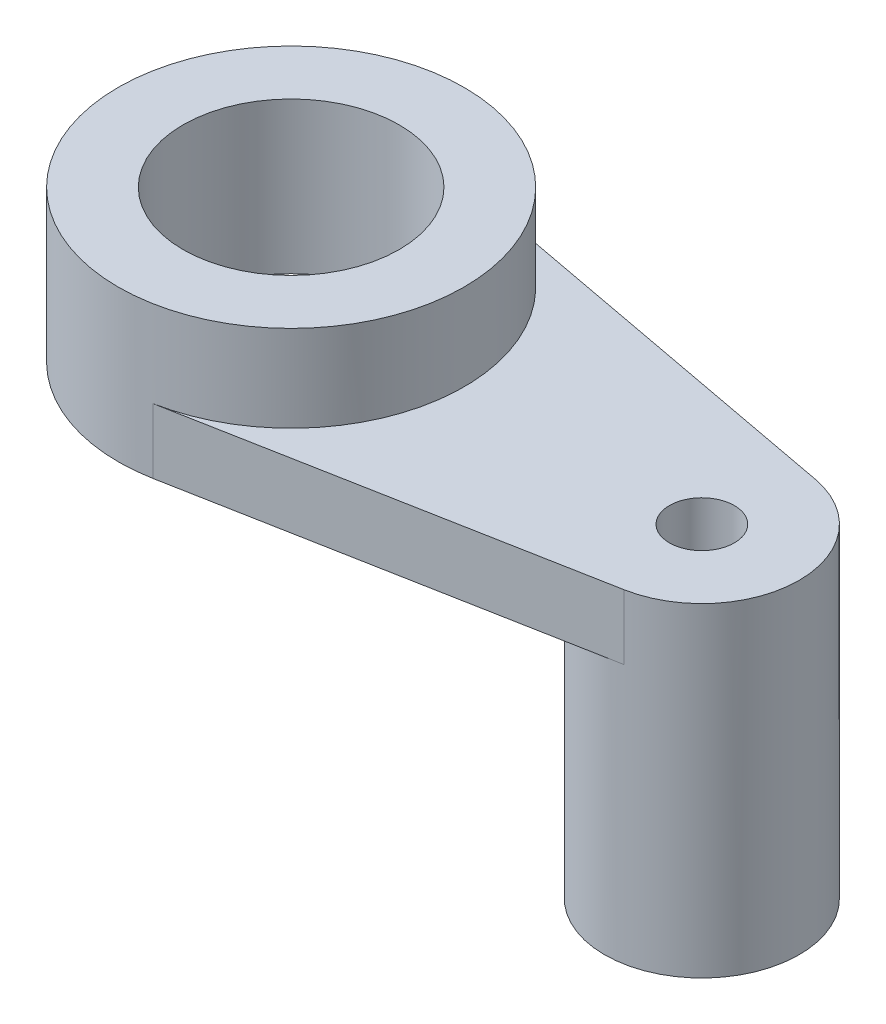
ISO-10303-21;
HEADER;
FILE_DESCRIPTION(('STEP AP214'),'2;1');
FILE_NAME('part.step','',(''),(''),'','','');
FILE_SCHEMA(('AUTOMOTIVE_DESIGN { 1 0 10303 214 1 1 1 1 }'));
ENDSEC;
DATA;
#1=APPLICATION_CONTEXT('core data for automotive mechanical design processes');
#2=APPLICATION_PROTOCOL_DEFINITION('international standard','automotive_design',2000,#1);
#3=PRODUCT_CONTEXT('',#1,'mechanical');
#4=PRODUCT('Part','Part','',(#3));
#5=PRODUCT_RELATED_PRODUCT_CATEGORY('part','',(#4));
#6=PRODUCT_DEFINITION_FORMATION('','',#4);
#7=PRODUCT_DEFINITION_CONTEXT('part definition',#1,'design');
#8=PRODUCT_DEFINITION('design','',#6,#7);
#9=PRODUCT_DEFINITION_SHAPE('','',#8);
#10=(LENGTH_UNIT() NAMED_UNIT(*) SI_UNIT(.MILLI.,.METRE.));
#11=(NAMED_UNIT(*) PLANE_ANGLE_UNIT() SI_UNIT($,.RADIAN.));
#12=(NAMED_UNIT(*) SI_UNIT($,.STERADIAN.) SOLID_ANGLE_UNIT());
#13=UNCERTAINTY_MEASURE_WITH_UNIT(LENGTH_MEASURE(1.E-05),#10,'distance_accuracy_value','');
#14=(GEOMETRIC_REPRESENTATION_CONTEXT(3) GLOBAL_UNCERTAINTY_ASSIGNED_CONTEXT((#13)) GLOBAL_UNIT_ASSIGNED_CONTEXT((#10,
#11,#12)) REPRESENTATION_CONTEXT('',''));
#15=CARTESIAN_POINT('',(0.,0.,0.));
#16=DIRECTION('',(0.,0.,1.));
#17=DIRECTION('',(1.,0.,0.));
#18=AXIS2_PLACEMENT_3D('',#15,#16,#17);
#19=CARTESIAN_POINT('',(0.,6.,0.));
#20=DIRECTION('',(0.,-1.,0.));
#21=DIRECTION('',(0.,0.,-1.));
#22=AXIS2_PLACEMENT_3D('',#19,#20,#21);
#23=CYLINDRICAL_SURFACE('',#22,16.);
#24=CARTESIAN_POINT('',(0.,0.,0.));
#25=DIRECTION('',(0.,1.,0.));
#26=DIRECTION('',(0.,0.,1.));
#27=AXIS2_PLACEMENT_3D('',#24,#25,#26);
#28=CIRCLE('',#27,16.);
#29=CARTESIAN_POINT('',(2.94736842105263,0.,-15.7261889658805));
#30=VERTEX_POINT('',#29);
#31=CARTESIAN_POINT('',(2.94736842105263,0.,15.7261889658805));
#32=VERTEX_POINT('',#31);
#33=EDGE_CURVE('E91',#30,#32,#28,.T.);
#34=ORIENTED_EDGE('',*,*,#33,.T.);
#35=DIRECTION('',(0.,-1.,0.));
#36=VECTOR('',#35,1.);
#37=CARTESIAN_POINT('',(2.94736842105263,6.,15.7261889658805));
#38=LINE('',#37,#36);
#39=CARTESIAN_POINT('',(2.94736842128359,6.,15.7261889658372));
#40=VERTEX_POINT('',#39);
#41=EDGE_CURVE('E51',#40,#32,#38,.T.);
#42=ORIENTED_EDGE('',*,*,#41,.F.);
#43=CARTESIAN_POINT('',(0.,6.,0.));
#44=DIRECTION('',(0.,1.,0.));
#45=DIRECTION('',(0.,0.,1.));
#46=AXIS2_PLACEMENT_3D('',#43,#44,#45);
#47=CIRCLE('',#46,16.);
#48=CARTESIAN_POINT('',(2.94736842105263,6.,-15.7261889658805));
#49=VERTEX_POINT('',#48);
#50=EDGE_CURVE('E90',#40,#49,#47,.T.);
#51=ORIENTED_EDGE('',*,*,#50,.T.);
#52=DIRECTION('',(0.,-1.,0.));
#53=VECTOR('',#52,1.);
#54=CARTESIAN_POINT('',(2.94736842105263,6.,-15.7261889658805));
#55=LINE('',#54,#53);
#56=EDGE_CURVE('E59',#49,#30,#55,.T.);
#57=ORIENTED_EDGE('',*,*,#56,.T.);
#58=EDGE_LOOP('',(#34,#42,#51,#57));
#59=FACE_BOUND('',#58,.T.);
#60=CARTESIAN_POINT('',(0.,14.,0.));
#61=DIRECTION('',(0.,1.,0.));
#62=DIRECTION('',(0.,0.,1.));
#63=AXIS2_PLACEMENT_3D('',#60,#61,#62);
#64=CIRCLE('',#63,16.);
#65=CARTESIAN_POINT('',(0.,14.,16.));
#66=VERTEX_POINT('',#65);
#67=EDGE_CURVE('E102',#66,#66,#64,.T.);
#68=ORIENTED_EDGE('',*,*,#67,.F.);
#69=EDGE_LOOP('',(#68));
#70=FACE_BOUND('',#69,.T.);
#71=ADVANCED_FACE('F43',(#59,#70),#23,.T.);
#72=CARTESIAN_POINT('',(2.94736842128359,6.,15.7261889658372));
#73=DIRECTION('',(-0.184210526330224,0.,-0.982886810364826));
#74=DIRECTION('',(-0.982886810364826,0.,0.184210526330224));
#75=AXIS2_PLACEMENT_3D('',#72,#73,#74);
#76=PLANE('',#75);
#77=DIRECTION('',(0.982886810364826,0.,-0.184210526330224));
#78=VECTOR('',#77,1.);
#79=CARTESIAN_POINT('',(2.94736842128359,0.,15.7261889658372));
#80=LINE('',#79,#78);
#81=CARTESIAN_POINT('',(39.6578947362068,0.,8.84598129328825));
#82=VERTEX_POINT('',#81);
#83=EDGE_CURVE('E117',#32,#82,#80,.T.);
#84=ORIENTED_EDGE('',*,*,#83,.T.);
#85=DIRECTION('',(0.,-1.,0.));
#86=VECTOR('',#85,1.);
#87=CARTESIAN_POINT('',(39.6578947362068,6.,8.84598129328825));
#88=LINE('',#87,#86);
#89=CARTESIAN_POINT('',(39.6578947362068,6.,8.84598129328825));
#90=VERTEX_POINT('',#89);
#91=EDGE_CURVE('E93',#90,#82,#88,.T.);
#92=ORIENTED_EDGE('',*,*,#91,.F.);
#93=DIRECTION('',(0.982886810364826,0.,-0.184210526330224));
#94=VECTOR('',#93,1.);
#95=CARTESIAN_POINT('',(2.94736842128359,6.,15.7261889658372));
#96=LINE('',#95,#94);
#97=EDGE_CURVE('E82',#40,#90,#96,.T.);
#98=ORIENTED_EDGE('',*,*,#97,.F.);
#99=ORIENTED_EDGE('',*,*,#41,.T.);
#100=EDGE_LOOP('',(#84,#92,#98,#99));
#101=FACE_BOUND('',#100,.T.);
#102=ADVANCED_FACE('F94',(#101),#76,.F.);
#103=CARTESIAN_POINT('',(37.9999999991816,6.,-2.79037607116797E-10));
#104=DIRECTION('',(0.,-1.,0.));
#105=DIRECTION('',(0.,0.,-1.));
#106=AXIS2_PLACEMENT_3D('',#103,#104,#105);
#107=CYLINDRICAL_SURFACE('',#106,9.00000000070109);
#108=ORIENTED_EDGE('',*,*,#91,.T.);
#109=CARTESIAN_POINT('',(38.,0.,0.));
#110=DIRECTION('',(0.,1.,0.));
#111=DIRECTION('',(0.,0.,1.));
#112=AXIS2_PLACEMENT_3D('',#109,#110,#111);
#113=CIRCLE('',#112,9.);
#114=CARTESIAN_POINT('',(39.6578947368421,0.,-8.8459812933078));
#115=VERTEX_POINT('',#114);
#116=EDGE_CURVE('E11',#115,#82,#113,.T.);
#117=ORIENTED_EDGE('',*,*,#116,.F.);
#118=DIRECTION('',(0.,-1.,0.));
#119=VECTOR('',#118,1.);
#120=CARTESIAN_POINT('',(39.6578947360769,6.,-8.84598129387068));
#121=LINE('',#120,#119);
#122=CARTESIAN_POINT('',(39.6578947360769,6.,-8.84598129387068));
#123=VERTEX_POINT('',#122);
#124=EDGE_CURVE('E121',#123,#115,#121,.T.);
#125=ORIENTED_EDGE('',*,*,#124,.F.);
#126=CARTESIAN_POINT('',(37.9999999991816,6.,-2.79037607116797E-10));
#127=DIRECTION('',(0.,1.,0.));
#128=DIRECTION('',(0.,0.,1.));
#129=AXIS2_PLACEMENT_3D('',#126,#127,#128);
#130=CIRCLE('',#129,9.00000000070109);
#131=EDGE_CURVE('E97',#90,#123,#130,.T.);
#132=ORIENTED_EDGE('',*,*,#131,.F.);
#133=EDGE_LOOP('',(#108,#117,#125,#132));
#134=FACE_BOUND('',#133,.T.);
#135=CARTESIAN_POINT('',(38.,-24.,0.));
#136=DIRECTION('',(0.,1.,0.));
#137=DIRECTION('',(0.,0.,1.));
#138=AXIS2_PLACEMENT_3D('',#135,#136,#137);
#139=CIRCLE('',#138,9.);
#140=CARTESIAN_POINT('',(38.,-24.,9.));
#141=VERTEX_POINT('',#140);
#142=EDGE_CURVE('E106',#141,#141,#139,.T.);
#143=ORIENTED_EDGE('',*,*,#142,.T.);
#144=EDGE_LOOP('',(#143));
#145=FACE_BOUND('',#144,.T.);
#146=ADVANCED_FACE('F125',(#134,#145),#107,.T.);
#147=CARTESIAN_POINT('',(2.94736842105263,6.,-15.7261889658805));
#148=DIRECTION('',(0.184210526315789,0.,-0.982886810367531));
#149=DIRECTION('',(-0.982886810367532,0.,-0.184210526315789));
#150=AXIS2_PLACEMENT_3D('',#147,#148,#149);
#151=PLANE('',#150);
#152=DIRECTION('',(0.982886810367532,0.,0.184210526315789));
#153=VECTOR('',#152,1.);
#154=CARTESIAN_POINT('',(2.94736842105263,0.,-15.7261889658805));
#155=LINE('',#154,#153);
#156=EDGE_CURVE('E98',#30,#115,#155,.T.);
#157=ORIENTED_EDGE('',*,*,#156,.F.);
#158=ORIENTED_EDGE('',*,*,#56,.F.);
#159=DIRECTION('',(0.982886810367532,0.,0.184210526315789));
#160=VECTOR('',#159,1.);
#161=CARTESIAN_POINT('',(2.94736842105263,6.,-15.7261889658805));
#162=LINE('',#161,#160);
#163=EDGE_CURVE('E101',#49,#123,#162,.T.);
#164=ORIENTED_EDGE('',*,*,#163,.T.);
#165=ORIENTED_EDGE('',*,*,#124,.T.);
#166=EDGE_LOOP('',(#157,#158,#164,#165));
#167=FACE_BOUND('',#166,.T.);
#168=ADVANCED_FACE('F128',(#167),#151,.T.);
#169=CARTESIAN_POINT('',(0.,6.,0.));
#170=DIRECTION('',(0.,1.,0.));
#171=DIRECTION('',(0.,0.,1.));
#172=AXIS2_PLACEMENT_3D('',#169,#170,#171);
#173=PLANE('',#172);
#174=CARTESIAN_POINT('',(38.,6.,0.));
#175=DIRECTION('',(0.,1.,0.));
#176=DIRECTION('',(0.,0.,1.));
#177=AXIS2_PLACEMENT_3D('',#174,#175,#176);
#178=CIRCLE('',#177,3.);
#179=CARTESIAN_POINT('',(38.,6.,3.));
#180=VERTEX_POINT('',#179);
#181=EDGE_CURVE('E262',#180,#180,#178,.T.);
#182=ORIENTED_EDGE('',*,*,#181,.F.);
#183=EDGE_LOOP('',(#182));
#184=FACE_BOUND('',#183,.T.);
#185=ORIENTED_EDGE('',*,*,#50,.F.);
#186=ORIENTED_EDGE('',*,*,#97,.T.);
#187=ORIENTED_EDGE('',*,*,#131,.T.);
#188=ORIENTED_EDGE('',*,*,#163,.F.);
#189=EDGE_LOOP('',(#185,#186,#187,#188));
#190=FACE_BOUND('',#189,.T.);
#191=ADVANCED_FACE('F100',(#184,#190),#173,.T.);
#192=CARTESIAN_POINT('',(0.,0.,0.));
#193=DIRECTION('',(0.,1.,0.));
#194=DIRECTION('',(0.,0.,1.));
#195=AXIS2_PLACEMENT_3D('',#192,#193,#194);
#196=PLANE('',#195);
#197=CARTESIAN_POINT('',(0.,0.,0.));
#198=DIRECTION('',(0.,1.,0.));
#199=DIRECTION('',(0.,0.,1.));
#200=AXIS2_PLACEMENT_3D('',#197,#198,#199);
#201=CIRCLE('',#200,10.);
#202=CARTESIAN_POINT('',(0.,0.,10.));
#203=VERTEX_POINT('',#202);
#204=EDGE_CURVE('E103',#203,#203,#201,.T.);
#205=ORIENTED_EDGE('',*,*,#204,.T.);
#206=EDGE_LOOP('',(#205));
#207=FACE_BOUND('',#206,.T.);
#208=ORIENTED_EDGE('',*,*,#156,.T.);
#209=ORIENTED_EDGE('',*,*,#116,.T.);
#210=ORIENTED_EDGE('',*,*,#83,.F.);
#211=ORIENTED_EDGE('',*,*,#33,.F.);
#212=EDGE_LOOP('',(#208,#209,#210,#211));
#213=FACE_BOUND('',#212,.T.);
#214=ADVANCED_FACE('F135',(#207,#213),#196,.F.);
#215=CARTESIAN_POINT('',(38.,-24.,0.));
#216=DIRECTION('',(0.,1.,0.));
#217=DIRECTION('',(0.,0.,1.));
#218=AXIS2_PLACEMENT_3D('',#215,#216,#217);
#219=PLANE('',#218);
#220=CARTESIAN_POINT('',(38.,-24.,0.));
#221=DIRECTION('',(0.,1.,0.));
#222=DIRECTION('',(0.,0.,1.));
#223=AXIS2_PLACEMENT_3D('',#220,#221,#222);
#224=CIRCLE('',#223,3.);
#225=CARTESIAN_POINT('',(38.,-24.,3.));
#226=VERTEX_POINT('',#225);
#227=EDGE_CURVE('E259',#226,#226,#224,.T.);
#228=ORIENTED_EDGE('',*,*,#227,.T.);
#229=EDGE_LOOP('',(#228));
#230=FACE_BOUND('',#229,.T.);
#231=ORIENTED_EDGE('',*,*,#142,.F.);
#232=EDGE_LOOP('',(#231));
#233=FACE_BOUND('',#232,.T.);
#234=ADVANCED_FACE('F173',(#230,#233),#219,.F.);
#235=CARTESIAN_POINT('',(0.,14.,0.));
#236=DIRECTION('',(0.,1.,0.));
#237=DIRECTION('',(0.,0.,1.));
#238=AXIS2_PLACEMENT_3D('',#235,#236,#237);
#239=PLANE('',#238);
#240=CARTESIAN_POINT('',(0.,14.,0.));
#241=DIRECTION('',(0.,1.,0.));
#242=DIRECTION('',(0.,0.,1.));
#243=AXIS2_PLACEMENT_3D('',#240,#241,#242);
#244=CIRCLE('',#243,10.);
#245=CARTESIAN_POINT('',(0.,14.,10.));
#246=VERTEX_POINT('',#245);
#247=EDGE_CURVE('E109',#246,#246,#244,.T.);
#248=ORIENTED_EDGE('',*,*,#247,.F.);
#249=EDGE_LOOP('',(#248));
#250=FACE_BOUND('',#249,.T.);
#251=ORIENTED_EDGE('',*,*,#67,.T.);
#252=EDGE_LOOP('',(#251));
#253=FACE_BOUND('',#252,.T.);
#254=ADVANCED_FACE('F180',(#250,#253),#239,.T.);
#255=CARTESIAN_POINT('',(0.,-24.,0.));
#256=DIRECTION('',(0.,1.,0.));
#257=DIRECTION('',(0.,0.,1.));
#258=AXIS2_PLACEMENT_3D('',#255,#256,#257);
#259=CYLINDRICAL_SURFACE('',#258,10.);
#260=ORIENTED_EDGE('',*,*,#247,.T.);
#261=EDGE_LOOP('',(#260));
#262=FACE_BOUND('',#261,.T.);
#263=ORIENTED_EDGE('',*,*,#204,.F.);
#264=EDGE_LOOP('',(#263));
#265=FACE_BOUND('',#264,.T.);
#266=ADVANCED_FACE('F184',(#262,#265),#259,.F.);
#267=CARTESIAN_POINT('',(38.,-24.,0.));
#268=DIRECTION('',(0.,1.,0.));
#269=DIRECTION('',(0.,0.,1.));
#270=AXIS2_PLACEMENT_3D('',#267,#268,#269);
#271=CYLINDRICAL_SURFACE('',#270,3.);
#272=ORIENTED_EDGE('',*,*,#227,.F.);
#273=EDGE_LOOP('',(#272));
#274=FACE_BOUND('',#273,.T.);
#275=ORIENTED_EDGE('',*,*,#181,.T.);
#276=EDGE_LOOP('',(#275));
#277=FACE_BOUND('',#276,.T.);
#278=ADVANCED_FACE('F195',(#274,#277),#271,.F.);
#279=CLOSED_SHELL('',(#71,#102,#146,#168,#191,#214,#234,#254,#266,#278));
#280=MANIFOLD_SOLID_BREP('B2',#279);
#281=ADVANCED_BREP_SHAPE_REPRESENTATION('',(#18,#280),#14);
#282=SHAPE_DEFINITION_REPRESENTATION(#9,#281);
ENDSEC;
END-ISO-10303-21;
